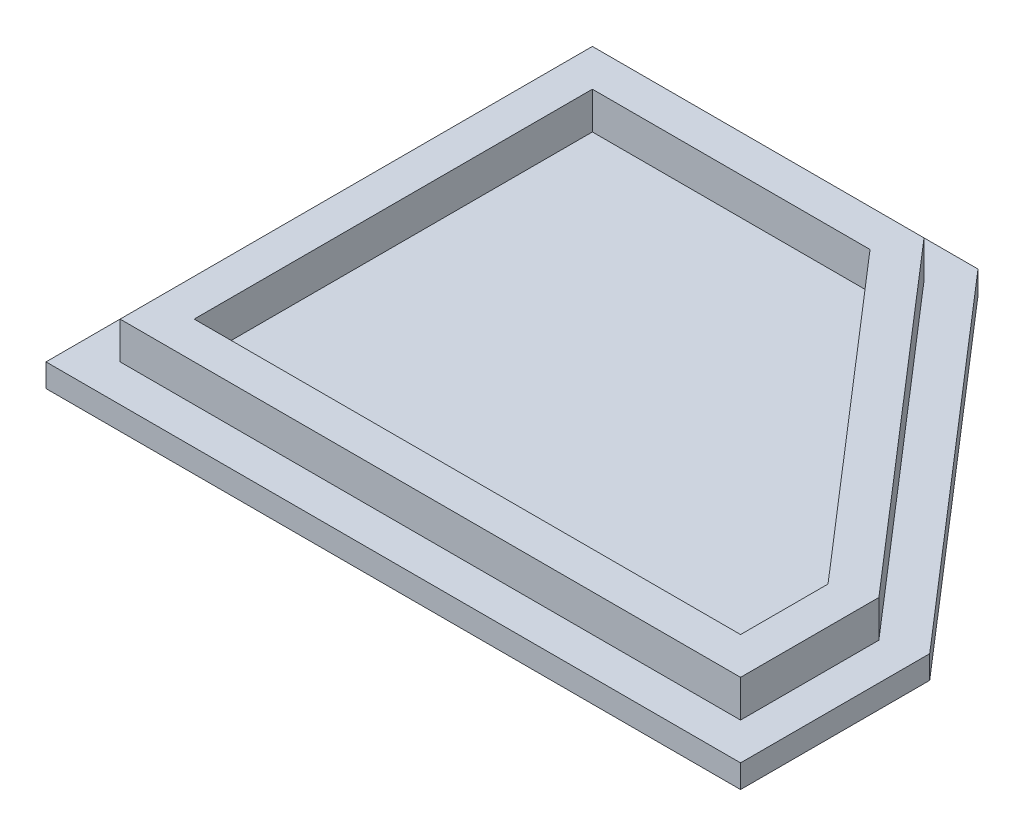
ISO-10303-21;
HEADER;
FILE_DESCRIPTION(('STEP AP214'),'2;1');
FILE_NAME('part.step','',(''),(''),'','','');
FILE_SCHEMA(('AUTOMOTIVE_DESIGN { 1 0 10303 214 1 1 1 1 }'));
ENDSEC;
DATA;
#1=APPLICATION_CONTEXT('core data for automotive mechanical design processes');
#2=APPLICATION_PROTOCOL_DEFINITION('international standard','automotive_design',2000,#1);
#3=PRODUCT_CONTEXT('',#1,'mechanical');
#4=PRODUCT('Part','Part','',(#3));
#5=PRODUCT_RELATED_PRODUCT_CATEGORY('part','',(#4));
#6=PRODUCT_DEFINITION_FORMATION('','',#4);
#7=PRODUCT_DEFINITION_CONTEXT('part definition',#1,'design');
#8=PRODUCT_DEFINITION('design','',#6,#7);
#9=PRODUCT_DEFINITION_SHAPE('','',#8);
#10=(LENGTH_UNIT() NAMED_UNIT(*) SI_UNIT(.MILLI.,.METRE.));
#11=(NAMED_UNIT(*) PLANE_ANGLE_UNIT() SI_UNIT($,.RADIAN.));
#12=(NAMED_UNIT(*) SI_UNIT($,.STERADIAN.) SOLID_ANGLE_UNIT());
#13=UNCERTAINTY_MEASURE_WITH_UNIT(LENGTH_MEASURE(1.E-05),#10,'distance_accuracy_value','');
#14=(GEOMETRIC_REPRESENTATION_CONTEXT(3) GLOBAL_UNCERTAINTY_ASSIGNED_CONTEXT((#13)) GLOBAL_UNIT_ASSIGNED_CONTEXT((#10,
#11,#12)) REPRESENTATION_CONTEXT('',''));
#15=CARTESIAN_POINT('',(0.,0.,0.));
#16=DIRECTION('',(0.,0.,1.));
#17=DIRECTION('',(1.,0.,0.));
#18=AXIS2_PLACEMENT_3D('',#15,#16,#17);
#19=CARTESIAN_POINT('',(-52.9147869932674,2.5,27.4036149516564));
#20=DIRECTION('',(1.,0.,0.));
#21=DIRECTION('',(0.,0.,-1.));
#22=AXIS2_PLACEMENT_3D('',#19,#20,#21);
#23=PLANE('',#22);
#24=DIRECTION('',(0.,0.,1.));
#25=VECTOR('',#24,1.);
#26=CARTESIAN_POINT('',(-52.9147869932674,0.,27.4036149516564));
#27=LINE('',#26,#25);
#28=CARTESIAN_POINT('',(-52.9147869932674,0.,-31.5963850483436));
#29=VERTEX_POINT('',#28);
#30=CARTESIAN_POINT('',(-52.9147869932674,0.,27.4036149516564));
#31=VERTEX_POINT('',#30);
#32=EDGE_CURVE('E222',#29,#31,#27,.T.);
#33=ORIENTED_EDGE('',*,*,#32,.T.);
#34=DIRECTION('',(0.,-1.,0.));
#35=VECTOR('',#34,1.);
#36=CARTESIAN_POINT('',(-52.9147869932674,2.5,27.4036149516564));
#37=LINE('',#36,#35);
#38=CARTESIAN_POINT('',(-52.9147869932674,2.5,27.4036149516564));
#39=VERTEX_POINT('',#38);
#40=EDGE_CURVE('E11',#39,#31,#37,.T.);
#41=ORIENTED_EDGE('',*,*,#40,.F.);
#42=DIRECTION('',(0.,0.,1.));
#43=VECTOR('',#42,1.);
#44=CARTESIAN_POINT('',(-52.9147869932674,2.5,27.4036149516564));
#45=LINE('',#44,#43);
#46=CARTESIAN_POINT('',(-52.9147869932674,2.5,-31.5963850483436));
#47=VERTEX_POINT('',#46);
#48=EDGE_CURVE('E229',#47,#39,#45,.T.);
#49=ORIENTED_EDGE('',*,*,#48,.F.);
#50=DIRECTION('',(0.,-1.,0.));
#51=VECTOR('',#50,1.);
#52=CARTESIAN_POINT('',(-52.9147869932674,2.5,-31.5963850483436));
#53=LINE('',#52,#51);
#54=EDGE_CURVE('E241',#47,#29,#53,.T.);
#55=ORIENTED_EDGE('',*,*,#54,.T.);
#56=EDGE_LOOP('',(#33,#41,#49,#55));
#57=FACE_BOUND('',#56,.T.);
#58=ADVANCED_FACE('F34',(#57),#23,.F.);
#59=CARTESIAN_POINT('',(22.0852130067326,2.5,27.4036149516564));
#60=DIRECTION('',(0.,0.,-1.));
#61=DIRECTION('',(-1.,0.,0.));
#62=AXIS2_PLACEMENT_3D('',#59,#60,#61);
#63=PLANE('',#62);
#64=DIRECTION('',(1.,0.,0.));
#65=VECTOR('',#64,1.);
#66=CARTESIAN_POINT('',(22.0852130067326,0.,27.4036149516564));
#67=LINE('',#66,#65);
#68=CARTESIAN_POINT('',(22.0852130067326,0.,27.4036149516564));
#69=VERTEX_POINT('',#68);
#70=EDGE_CURVE('E244',#31,#69,#67,.T.);
#71=ORIENTED_EDGE('',*,*,#70,.T.);
#72=DIRECTION('',(0.,-1.,0.));
#73=VECTOR('',#72,1.);
#74=CARTESIAN_POINT('',(22.0852130067326,2.5,27.4036149516564));
#75=LINE('',#74,#73);
#76=CARTESIAN_POINT('',(22.0852130067326,2.5,27.4036149516564));
#77=VERTEX_POINT('',#76);
#78=EDGE_CURVE('E41',#77,#69,#75,.T.);
#79=ORIENTED_EDGE('',*,*,#78,.F.);
#80=DIRECTION('',(1.,0.,0.));
#81=VECTOR('',#80,1.);
#82=CARTESIAN_POINT('',(22.0852130067326,2.5,27.4036149516564));
#83=LINE('',#82,#81);
#84=EDGE_CURVE('E232',#39,#77,#83,.T.);
#85=ORIENTED_EDGE('',*,*,#84,.F.);
#86=ORIENTED_EDGE('',*,*,#40,.T.);
#87=EDGE_LOOP('',(#71,#79,#85,#86));
#88=FACE_BOUND('',#87,.T.);
#89=ADVANCED_FACE('F283',(#88),#63,.F.);
#90=CARTESIAN_POINT('',(22.0852130067325,2.5,6.97964896242533));
#91=DIRECTION('',(-1.,0.,0.));
#92=DIRECTION('',(0.,0.,1.));
#93=AXIS2_PLACEMENT_3D('',#90,#91,#92);
#94=PLANE('',#93);
#95=DIRECTION('',(0.,0.,-1.));
#96=VECTOR('',#95,1.);
#97=CARTESIAN_POINT('',(22.0852130067325,0.,6.97964896242533));
#98=LINE('',#97,#96);
#99=CARTESIAN_POINT('',(22.0852130067325,0.,6.97964896242533));
#100=VERTEX_POINT('',#99);
#101=EDGE_CURVE('E246',#69,#100,#98,.T.);
#102=ORIENTED_EDGE('',*,*,#101,.T.);
#103=DIRECTION('',(0.,-1.,0.));
#104=VECTOR('',#103,1.);
#105=CARTESIAN_POINT('',(22.0852130067325,2.5,6.97964896242533));
#106=LINE('',#105,#104);
#107=CARTESIAN_POINT('',(22.0852130067325,2.5,6.97964896242533));
#108=VERTEX_POINT('',#107);
#109=EDGE_CURVE('E256',#108,#100,#106,.T.);
#110=ORIENTED_EDGE('',*,*,#109,.F.);
#111=DIRECTION('',(0.,0.,-1.));
#112=VECTOR('',#111,1.);
#113=CARTESIAN_POINT('',(22.0852130067325,2.5,6.97964896242533));
#114=LINE('',#113,#112);
#115=EDGE_CURVE('E235',#77,#108,#114,.T.);
#116=ORIENTED_EDGE('',*,*,#115,.F.);
#117=ORIENTED_EDGE('',*,*,#78,.T.);
#118=EDGE_LOOP('',(#102,#110,#116,#117));
#119=FACE_BOUND('',#118,.T.);
#120=ADVANCED_FACE('F263',(#119),#94,.F.);
#121=CARTESIAN_POINT('',(-11.2747869932674,2.5,-31.5963850483436));
#122=DIRECTION('',(-0.756392823740567,0.,0.654117647058823));
#123=DIRECTION('',(0.654117647058823,0.,0.756392823740567));
#124=AXIS2_PLACEMENT_3D('',#121,#122,#123);
#125=PLANE('',#124);
#126=DIRECTION('',(-0.654117647058823,0.,-0.756392823740567));
#127=VECTOR('',#126,1.);
#128=CARTESIAN_POINT('',(-11.2747869932674,0.,-31.5963850483436));
#129=LINE('',#128,#127);
#130=CARTESIAN_POINT('',(-11.2747869932674,0.,-31.5963850483436));
#131=VERTEX_POINT('',#130);
#132=EDGE_CURVE('E248',#100,#131,#129,.T.);
#133=ORIENTED_EDGE('',*,*,#132,.T.);
#134=DIRECTION('',(0.,-1.,0.));
#135=VECTOR('',#134,1.);
#136=CARTESIAN_POINT('',(-11.2747869932674,2.5,-31.5963850483436));
#137=LINE('',#136,#135);
#138=CARTESIAN_POINT('',(-11.2747869932674,2.5,-31.5963850483436));
#139=VERTEX_POINT('',#138);
#140=EDGE_CURVE('E253',#139,#131,#137,.T.);
#141=ORIENTED_EDGE('',*,*,#140,.F.);
#142=DIRECTION('',(-0.654117647058823,0.,-0.756392823740567));
#143=VECTOR('',#142,1.);
#144=CARTESIAN_POINT('',(-11.2747869932674,2.5,-31.5963850483436));
#145=LINE('',#144,#143);
#146=EDGE_CURVE('E237',#108,#139,#145,.T.);
#147=ORIENTED_EDGE('',*,*,#146,.F.);
#148=ORIENTED_EDGE('',*,*,#109,.T.);
#149=EDGE_LOOP('',(#133,#141,#147,#148));
#150=FACE_BOUND('',#149,.T.);
#151=ADVANCED_FACE('F273',(#150),#125,.F.);
#152=CARTESIAN_POINT('',(-52.9147869932674,2.5,-31.5963850483436));
#153=DIRECTION('',(0.,0.,1.));
#154=DIRECTION('',(1.,0.,0.));
#155=AXIS2_PLACEMENT_3D('',#152,#153,#154);
#156=PLANE('',#155);
#157=DIRECTION('',(-1.,0.,0.));
#158=VECTOR('',#157,1.);
#159=CARTESIAN_POINT('',(-52.9147869932674,0.,-31.5963850483436));
#160=LINE('',#159,#158);
#161=EDGE_CURVE('E233',#131,#29,#160,.T.);
#162=ORIENTED_EDGE('',*,*,#161,.T.);
#163=ORIENTED_EDGE('',*,*,#54,.F.);
#164=DIRECTION('',(-1.,0.,0.));
#165=VECTOR('',#164,1.);
#166=CARTESIAN_POINT('',(-52.9147869932674,2.5,-31.5963850483436));
#167=LINE('',#166,#165);
#168=EDGE_CURVE('E239',#139,#47,#167,.T.);
#169=ORIENTED_EDGE('',*,*,#168,.F.);
#170=ORIENTED_EDGE('',*,*,#140,.T.);
#171=EDGE_LOOP('',(#162,#163,#169,#170));
#172=FACE_BOUND('',#171,.T.);
#173=ADVANCED_FACE('F277',(#172),#156,.F.);
#174=CARTESIAN_POINT('',(0.,2.5,0.));
#175=DIRECTION('',(0.,-1.,0.));
#176=DIRECTION('',(0.,0.,-1.));
#177=AXIS2_PLACEMENT_3D('',#174,#175,#176);
#178=PLANE('',#177);
#179=DIRECTION('',(0.,0.,1.));
#180=VECTOR('',#179,1.);
#181=CARTESIAN_POINT('',(18.0852130067325,2.5,0.));
#182=LINE('',#181,#180);
#183=CARTESIAN_POINT('',(18.0852130067325,2.5,8.46933313379595));
#184=VERTEX_POINT('',#183);
#185=CARTESIAN_POINT('',(18.0852130067325,2.5,23.4036149516564));
#186=VERTEX_POINT('',#185);
#187=EDGE_CURVE('E188',#184,#186,#182,.T.);
#188=ORIENTED_EDGE('',*,*,#187,.T.);
#189=DIRECTION('',(-1.,0.,0.));
#190=VECTOR('',#189,1.);
#191=CARTESIAN_POINT('',(0.,2.5,23.4036149516564));
#192=LINE('',#191,#190);
#193=CARTESIAN_POINT('',(-48.9147869932674,2.5,23.4036149516564));
#194=VERTEX_POINT('',#193);
#195=EDGE_CURVE('E146',#186,#194,#192,.T.);
#196=ORIENTED_EDGE('',*,*,#195,.T.);
#197=DIRECTION('',(0.,0.,-1.));
#198=VECTOR('',#197,1.);
#199=CARTESIAN_POINT('',(-48.9147869932674,2.5,0.));
#200=LINE('',#199,#198);
#201=CARTESIAN_POINT('',(-48.9147869932674,2.5,-27.5963850483436));
#202=VERTEX_POINT('',#201);
#203=EDGE_CURVE('E194',#194,#202,#200,.T.);
#204=ORIENTED_EDGE('',*,*,#203,.T.);
#205=DIRECTION('',(1.,0.,0.));
#206=VECTOR('',#205,1.);
#207=CARTESIAN_POINT('',(0.,2.5,-27.5963850483436));
#208=LINE('',#207,#206);
#209=CARTESIAN_POINT('',(-13.1039019297667,2.5,-27.5963850483436));
#210=VERTEX_POINT('',#209);
#211=EDGE_CURVE('E48',#202,#210,#208,.T.);
#212=ORIENTED_EDGE('',*,*,#211,.T.);
#213=DIRECTION('',(0.654117647058823,0.,0.756392823740567));
#214=VECTOR('',#213,1.);
#215=CARTESIAN_POINT('',(6.15672373704678,2.5,-5.3242462356432));
#216=LINE('',#215,#214);
#217=EDGE_CURVE('E190',#210,#184,#216,.T.);
#218=ORIENTED_EDGE('',*,*,#217,.T.);
#219=EDGE_LOOP('',(#188,#196,#204,#212,#218));
#220=FACE_BOUND('',#219,.T.);
#221=ORIENTED_EDGE('',*,*,#48,.T.);
#222=ORIENTED_EDGE('',*,*,#84,.T.);
#223=ORIENTED_EDGE('',*,*,#115,.T.);
#224=ORIENTED_EDGE('',*,*,#146,.T.);
#225=ORIENTED_EDGE('',*,*,#168,.T.);
#226=EDGE_LOOP('',(#221,#222,#223,#224,#225));
#227=FACE_BOUND('',#226,.T.);
#228=ADVANCED_FACE('F281',(#220,#227),#178,.F.);
#229=CARTESIAN_POINT('',(0.,0.,0.));
#230=DIRECTION('',(0.,-1.,0.));
#231=DIRECTION('',(0.,0.,-1.));
#232=AXIS2_PLACEMENT_3D('',#229,#230,#231);
#233=PLANE('',#232);
#234=ORIENTED_EDGE('',*,*,#32,.F.);
#235=ORIENTED_EDGE('',*,*,#161,.F.);
#236=ORIENTED_EDGE('',*,*,#132,.F.);
#237=ORIENTED_EDGE('',*,*,#101,.F.);
#238=ORIENTED_EDGE('',*,*,#70,.F.);
#239=EDGE_LOOP('',(#234,#235,#236,#237,#238));
#240=FACE_BOUND('',#239,.T.);
#241=ADVANCED_FACE('F269',(#240),#233,.T.);
#242=CARTESIAN_POINT('',(0.,6.5,19.4036149516564));
#243=DIRECTION('',(0.,0.,1.));
#244=DIRECTION('',(1.,0.,0.));
#245=AXIS2_PLACEMENT_3D('',#242,#243,#244);
#246=PLANE('',#245);
#247=DIRECTION('',(-1.,0.,0.));
#248=VECTOR('',#247,1.);
#249=CARTESIAN_POINT('',(0.,2.5,19.4036149516564));
#250=LINE('',#249,#248);
#251=CARTESIAN_POINT('',(14.0852130067325,2.5,19.4036149516564));
#252=VERTEX_POINT('',#251);
#253=CARTESIAN_POINT('',(-44.9147869932674,2.5,19.4036149516564));
#254=VERTEX_POINT('',#253);
#255=EDGE_CURVE('E197',#252,#254,#250,.T.);
#256=ORIENTED_EDGE('',*,*,#255,.T.);
#257=DIRECTION('',(0.,-1.,0.));
#258=VECTOR('',#257,1.);
#259=CARTESIAN_POINT('',(-44.9147869932674,6.5,19.4036149516564));
#260=LINE('',#259,#258);
#261=CARTESIAN_POINT('',(-44.9147869932674,6.5,19.4036149516564));
#262=VERTEX_POINT('',#261);
#263=EDGE_CURVE('E220',#262,#254,#260,.T.);
#264=ORIENTED_EDGE('',*,*,#263,.F.);
#265=DIRECTION('',(-1.,0.,0.));
#266=VECTOR('',#265,1.);
#267=CARTESIAN_POINT('',(0.,6.5,19.4036149516564));
#268=LINE('',#267,#266);
#269=CARTESIAN_POINT('',(14.0852130067325,6.5,19.4036149516564));
#270=VERTEX_POINT('',#269);
#271=EDGE_CURVE('E175',#270,#262,#268,.T.);
#272=ORIENTED_EDGE('',*,*,#271,.F.);
#273=DIRECTION('',(0.,-1.,0.));
#274=VECTOR('',#273,1.);
#275=CARTESIAN_POINT('',(14.0852130067325,6.5,19.4036149516564));
#276=LINE('',#275,#274);
#277=EDGE_CURVE('E151',#270,#252,#276,.T.);
#278=ORIENTED_EDGE('',*,*,#277,.T.);
#279=EDGE_LOOP('',(#256,#264,#272,#278));
#280=FACE_BOUND('',#279,.T.);
#281=ADVANCED_FACE('F300',(#280),#246,.F.);
#282=CARTESIAN_POINT('',(-44.9147869932674,6.5,0.));
#283=DIRECTION('',(-1.,0.,0.));
#284=DIRECTION('',(0.,0.,1.));
#285=AXIS2_PLACEMENT_3D('',#282,#283,#284);
#286=PLANE('',#285);
#287=DIRECTION('',(0.,0.,-1.));
#288=VECTOR('',#287,1.);
#289=CARTESIAN_POINT('',(-44.9147869932674,2.5,0.));
#290=LINE('',#289,#288);
#291=CARTESIAN_POINT('',(-44.9147869932674,2.5,-23.5963850483436));
#292=VERTEX_POINT('',#291);
#293=EDGE_CURVE('E56',#254,#292,#290,.T.);
#294=ORIENTED_EDGE('',*,*,#293,.T.);
#295=DIRECTION('',(0.,-1.,0.));
#296=VECTOR('',#295,1.);
#297=CARTESIAN_POINT('',(-44.9147869932674,6.5,-23.5963850483436));
#298=LINE('',#297,#296);
#299=CARTESIAN_POINT('',(-44.9147869932674,6.5,-23.5963850483436));
#300=VERTEX_POINT('',#299);
#301=EDGE_CURVE('E217',#300,#292,#298,.T.);
#302=ORIENTED_EDGE('',*,*,#301,.F.);
#303=DIRECTION('',(0.,0.,-1.));
#304=VECTOR('',#303,1.);
#305=CARTESIAN_POINT('',(-44.9147869932674,6.5,0.));
#306=LINE('',#305,#304);
#307=EDGE_CURVE('E178',#262,#300,#306,.T.);
#308=ORIENTED_EDGE('',*,*,#307,.F.);
#309=ORIENTED_EDGE('',*,*,#263,.T.);
#310=EDGE_LOOP('',(#294,#302,#308,#309));
#311=FACE_BOUND('',#310,.T.);
#312=ADVANCED_FACE('F324',(#311),#286,.F.);
#313=CARTESIAN_POINT('',(0.,6.5,-23.5963850483436));
#314=DIRECTION('',(0.,0.,-1.));
#315=DIRECTION('',(-1.,0.,0.));
#316=AXIS2_PLACEMENT_3D('',#313,#314,#315);
#317=PLANE('',#316);
#318=DIRECTION('',(1.,0.,0.));
#319=VECTOR('',#318,1.);
#320=CARTESIAN_POINT('',(0.,2.5,-23.5963850483436));
#321=LINE('',#320,#319);
#322=CARTESIAN_POINT('',(-14.9330168662659,2.5,-23.5963850483436));
#323=VERTEX_POINT('',#322);
#324=EDGE_CURVE('E201',#292,#323,#321,.T.);
#325=ORIENTED_EDGE('',*,*,#324,.T.);
#326=DIRECTION('',(0.,-1.,0.));
#327=VECTOR('',#326,1.);
#328=CARTESIAN_POINT('',(-14.9330168662659,6.5,-23.5963850483436));
#329=LINE('',#328,#327);
#330=CARTESIAN_POINT('',(-14.9330168662659,6.5,-23.5963850483436));
#331=VERTEX_POINT('',#330);
#332=EDGE_CURVE('E214',#331,#323,#329,.T.);
#333=ORIENTED_EDGE('',*,*,#332,.F.);
#334=DIRECTION('',(1.,0.,0.));
#335=VECTOR('',#334,1.);
#336=CARTESIAN_POINT('',(0.,6.5,-23.5963850483436));
#337=LINE('',#336,#335);
#338=EDGE_CURVE('E180',#300,#331,#337,.T.);
#339=ORIENTED_EDGE('',*,*,#338,.F.);
#340=ORIENTED_EDGE('',*,*,#301,.T.);
#341=EDGE_LOOP('',(#325,#333,#339,#340));
#342=FACE_BOUND('',#341,.T.);
#343=ADVANCED_FACE('F328',(#342),#317,.F.);
#344=CARTESIAN_POINT('',(3.13115244208451,6.5,-2.70777564740791));
#345=DIRECTION('',(0.756392823740567,0.,-0.654117647058823));
#346=DIRECTION('',(-0.654117647058823,0.,-0.756392823740567));
#347=AXIS2_PLACEMENT_3D('',#344,#345,#346);
#348=PLANE('',#347);
#349=DIRECTION('',(0.654117647058823,0.,0.756392823740567));
#350=VECTOR('',#349,1.);
#351=CARTESIAN_POINT('',(3.13115244208451,2.5,-2.70777564740791));
#352=LINE('',#351,#350);
#353=CARTESIAN_POINT('',(14.0852130067325,2.5,9.9590173051666));
#354=VERTEX_POINT('',#353);
#355=EDGE_CURVE('E204',#323,#354,#352,.T.);
#356=ORIENTED_EDGE('',*,*,#355,.T.);
#357=DIRECTION('',(0.,-1.,0.));
#358=VECTOR('',#357,1.);
#359=CARTESIAN_POINT('',(14.0852130067325,6.5,9.9590173051666));
#360=LINE('',#359,#358);
#361=CARTESIAN_POINT('',(14.0852130067325,6.5,9.9590173051666));
#362=VERTEX_POINT('',#361);
#363=EDGE_CURVE('E211',#362,#354,#360,.T.);
#364=ORIENTED_EDGE('',*,*,#363,.F.);
#365=DIRECTION('',(0.654117647058823,0.,0.756392823740567));
#366=VECTOR('',#365,1.);
#367=CARTESIAN_POINT('',(3.13115244208451,6.5,-2.70777564740791));
#368=LINE('',#367,#366);
#369=EDGE_CURVE('E182',#331,#362,#368,.T.);
#370=ORIENTED_EDGE('',*,*,#369,.F.);
#371=ORIENTED_EDGE('',*,*,#332,.T.);
#372=EDGE_LOOP('',(#356,#364,#370,#371));
#373=FACE_BOUND('',#372,.T.);
#374=ADVANCED_FACE('F307',(#373),#348,.F.);
#375=CARTESIAN_POINT('',(0.,6.5,23.4036149516564));
#376=DIRECTION('',(0.,0.,1.));
#377=DIRECTION('',(1.,0.,0.));
#378=AXIS2_PLACEMENT_3D('',#375,#376,#377);
#379=PLANE('',#378);
#380=ORIENTED_EDGE('',*,*,#195,.F.);
#381=DIRECTION('',(0.,-1.,0.));
#382=VECTOR('',#381,1.);
#383=CARTESIAN_POINT('',(18.0852130067325,6.5,23.4036149516564));
#384=LINE('',#383,#382);
#385=CARTESIAN_POINT('',(18.0852130067325,6.5,23.4036149516564));
#386=VERTEX_POINT('',#385);
#387=EDGE_CURVE('E140',#386,#186,#384,.T.);
#388=ORIENTED_EDGE('',*,*,#387,.F.);
#389=DIRECTION('',(-1.,0.,0.));
#390=VECTOR('',#389,1.);
#391=CARTESIAN_POINT('',(0.,6.5,23.4036149516564));
#392=LINE('',#391,#390);
#393=CARTESIAN_POINT('',(-48.9147869932674,6.5,23.4036149516564));
#394=VERTEX_POINT('',#393);
#395=EDGE_CURVE('E143',#386,#394,#392,.T.);
#396=ORIENTED_EDGE('',*,*,#395,.T.);
#397=DIRECTION('',(0.,-1.,0.));
#398=VECTOR('',#397,1.);
#399=CARTESIAN_POINT('',(-48.9147869932674,6.5,23.4036149516564));
#400=LINE('',#399,#398);
#401=EDGE_CURVE('E186',#394,#194,#400,.T.);
#402=ORIENTED_EDGE('',*,*,#401,.T.);
#403=EDGE_LOOP('',(#380,#388,#396,#402));
#404=FACE_BOUND('',#403,.T.);
#405=ADVANCED_FACE('F142',(#404),#379,.T.);
#406=CARTESIAN_POINT('',(18.0852130067325,6.5,0.));
#407=DIRECTION('',(1.,0.,0.));
#408=DIRECTION('',(0.,0.,-1.));
#409=AXIS2_PLACEMENT_3D('',#406,#407,#408);
#410=PLANE('',#409);
#411=ORIENTED_EDGE('',*,*,#187,.F.);
#412=DIRECTION('',(0.,-1.,0.));
#413=VECTOR('',#412,1.);
#414=CARTESIAN_POINT('',(18.0852130067325,6.5,8.46933313379595));
#415=LINE('',#414,#413);
#416=CARTESIAN_POINT('',(18.0852130067325,6.5,8.46933313379595));
#417=VERTEX_POINT('',#416);
#418=EDGE_CURVE('E152',#417,#184,#415,.T.);
#419=ORIENTED_EDGE('',*,*,#418,.F.);
#420=DIRECTION('',(0.,0.,1.));
#421=VECTOR('',#420,1.);
#422=CARTESIAN_POINT('',(18.0852130067325,6.5,0.));
#423=LINE('',#422,#421);
#424=EDGE_CURVE('E159',#417,#386,#423,.T.);
#425=ORIENTED_EDGE('',*,*,#424,.T.);
#426=ORIENTED_EDGE('',*,*,#387,.T.);
#427=EDGE_LOOP('',(#411,#419,#425,#426));
#428=FACE_BOUND('',#427,.T.);
#429=ADVANCED_FACE('F166',(#428),#410,.T.);
#430=CARTESIAN_POINT('',(6.15672373704678,6.5,-5.3242462356432));
#431=DIRECTION('',(0.756392823740567,0.,-0.654117647058823));
#432=DIRECTION('',(-0.654117647058823,0.,-0.756392823740567));
#433=AXIS2_PLACEMENT_3D('',#430,#431,#432);
#434=PLANE('',#433);
#435=ORIENTED_EDGE('',*,*,#217,.F.);
#436=DIRECTION('',(0.,-1.,0.));
#437=VECTOR('',#436,1.);
#438=CARTESIAN_POINT('',(-13.1039019297667,6.5,-27.5963850483436));
#439=LINE('',#438,#437);
#440=CARTESIAN_POINT('',(-13.1039019297667,6.5,-27.5963850483436));
#441=VERTEX_POINT('',#440);
#442=EDGE_CURVE('E226',#441,#210,#439,.T.);
#443=ORIENTED_EDGE('',*,*,#442,.F.);
#444=DIRECTION('',(0.654117647058823,0.,0.756392823740567));
#445=VECTOR('',#444,1.);
#446=CARTESIAN_POINT('',(6.15672373704678,6.5,-5.3242462356432));
#447=LINE('',#446,#445);
#448=EDGE_CURVE('E167',#441,#417,#447,.T.);
#449=ORIENTED_EDGE('',*,*,#448,.T.);
#450=ORIENTED_EDGE('',*,*,#418,.T.);
#451=EDGE_LOOP('',(#435,#443,#449,#450));
#452=FACE_BOUND('',#451,.T.);
#453=ADVANCED_FACE('F310',(#452),#434,.T.);
#454=CARTESIAN_POINT('',(0.,6.5,-27.5963850483436));
#455=DIRECTION('',(0.,0.,-1.));
#456=DIRECTION('',(-1.,0.,0.));
#457=AXIS2_PLACEMENT_3D('',#454,#455,#456);
#458=PLANE('',#457);
#459=ORIENTED_EDGE('',*,*,#211,.F.);
#460=DIRECTION('',(0.,-1.,0.));
#461=VECTOR('',#460,1.);
#462=CARTESIAN_POINT('',(-48.9147869932674,6.5,-27.5963850483436));
#463=LINE('',#462,#461);
#464=CARTESIAN_POINT('',(-48.9147869932674,6.5,-27.5963850483436));
#465=VERTEX_POINT('',#464);
#466=EDGE_CURVE('E224',#465,#202,#463,.T.);
#467=ORIENTED_EDGE('',*,*,#466,.F.);
#468=DIRECTION('',(1.,0.,0.));
#469=VECTOR('',#468,1.);
#470=CARTESIAN_POINT('',(0.,6.5,-27.5963850483436));
#471=LINE('',#470,#469);
#472=EDGE_CURVE('E169',#465,#441,#471,.T.);
#473=ORIENTED_EDGE('',*,*,#472,.T.);
#474=ORIENTED_EDGE('',*,*,#442,.T.);
#475=EDGE_LOOP('',(#459,#467,#473,#474));
#476=FACE_BOUND('',#475,.T.);
#477=ADVANCED_FACE('F313',(#476),#458,.T.);
#478=CARTESIAN_POINT('',(-48.9147869932674,6.5,0.));
#479=DIRECTION('',(-1.,0.,0.));
#480=DIRECTION('',(0.,0.,1.));
#481=AXIS2_PLACEMENT_3D('',#478,#479,#480);
#482=PLANE('',#481);
#483=ORIENTED_EDGE('',*,*,#203,.F.);
#484=ORIENTED_EDGE('',*,*,#401,.F.);
#485=DIRECTION('',(0.,0.,-1.));
#486=VECTOR('',#485,1.);
#487=CARTESIAN_POINT('',(-48.9147869932674,6.5,0.));
#488=LINE('',#487,#486);
#489=EDGE_CURVE('E163',#394,#465,#488,.T.);
#490=ORIENTED_EDGE('',*,*,#489,.T.);
#491=ORIENTED_EDGE('',*,*,#466,.T.);
#492=EDGE_LOOP('',(#483,#484,#490,#491));
#493=FACE_BOUND('',#492,.T.);
#494=ADVANCED_FACE('F317',(#493),#482,.T.);
#495=CARTESIAN_POINT('',(14.0852130067325,6.5,0.));
#496=DIRECTION('',(1.,0.,0.));
#497=DIRECTION('',(0.,0.,-1.));
#498=AXIS2_PLACEMENT_3D('',#495,#496,#497);
#499=PLANE('',#498);
#500=DIRECTION('',(0.,0.,1.));
#501=VECTOR('',#500,1.);
#502=CARTESIAN_POINT('',(14.0852130067325,2.5,0.));
#503=LINE('',#502,#501);
#504=EDGE_CURVE('E164',#354,#252,#503,.T.);
#505=ORIENTED_EDGE('',*,*,#504,.T.);
#506=ORIENTED_EDGE('',*,*,#277,.F.);
#507=DIRECTION('',(0.,0.,1.));
#508=VECTOR('',#507,1.);
#509=CARTESIAN_POINT('',(14.0852130067325,6.5,0.));
#510=LINE('',#509,#508);
#511=EDGE_CURVE('E184',#362,#270,#510,.T.);
#512=ORIENTED_EDGE('',*,*,#511,.F.);
#513=ORIENTED_EDGE('',*,*,#363,.T.);
#514=EDGE_LOOP('',(#505,#506,#512,#513));
#515=FACE_BOUND('',#514,.T.);
#516=ADVANCED_FACE('F320',(#515),#499,.F.);
#517=CARTESIAN_POINT('',(0.,6.5,0.));
#518=DIRECTION('',(0.,1.,0.));
#519=DIRECTION('',(0.,0.,1.));
#520=AXIS2_PLACEMENT_3D('',#517,#518,#519);
#521=PLANE('',#520);
#522=ORIENTED_EDGE('',*,*,#395,.F.);
#523=ORIENTED_EDGE('',*,*,#424,.F.);
#524=ORIENTED_EDGE('',*,*,#448,.F.);
#525=ORIENTED_EDGE('',*,*,#472,.F.);
#526=ORIENTED_EDGE('',*,*,#489,.F.);
#527=EDGE_LOOP('',(#522,#523,#524,#525,#526));
#528=FACE_BOUND('',#527,.T.);
#529=ORIENTED_EDGE('',*,*,#271,.T.);
#530=ORIENTED_EDGE('',*,*,#307,.T.);
#531=ORIENTED_EDGE('',*,*,#338,.T.);
#532=ORIENTED_EDGE('',*,*,#369,.T.);
#533=ORIENTED_EDGE('',*,*,#511,.T.);
#534=EDGE_LOOP('',(#529,#530,#531,#532,#533));
#535=FACE_BOUND('',#534,.T.);
#536=ADVANCED_FACE('F156',(#528,#535),#521,.T.);
#537=ORIENTED_EDGE('',*,*,#255,.F.);
#538=ORIENTED_EDGE('',*,*,#504,.F.);
#539=ORIENTED_EDGE('',*,*,#355,.F.);
#540=ORIENTED_EDGE('',*,*,#324,.F.);
#541=ORIENTED_EDGE('',*,*,#293,.F.);
#542=EDGE_LOOP('',(#537,#538,#539,#540,#541));
#543=FACE_BOUND('',#542,.T.);
#544=ADVANCED_FACE('F304',(#543),#178,.F.);
#545=CLOSED_SHELL('',(#58,#89,#120,#151,#173,#228,#241,#281,#312,#343,#374,#405,#429,#453,#477,
#494,#516,#536,#544));
#546=MANIFOLD_SOLID_BREP('B2',#545);
#547=ADVANCED_BREP_SHAPE_REPRESENTATION('',(#18,#546),#14);
#548=SHAPE_DEFINITION_REPRESENTATION(#9,#547);
ENDSEC;
END-ISO-10303-21;
